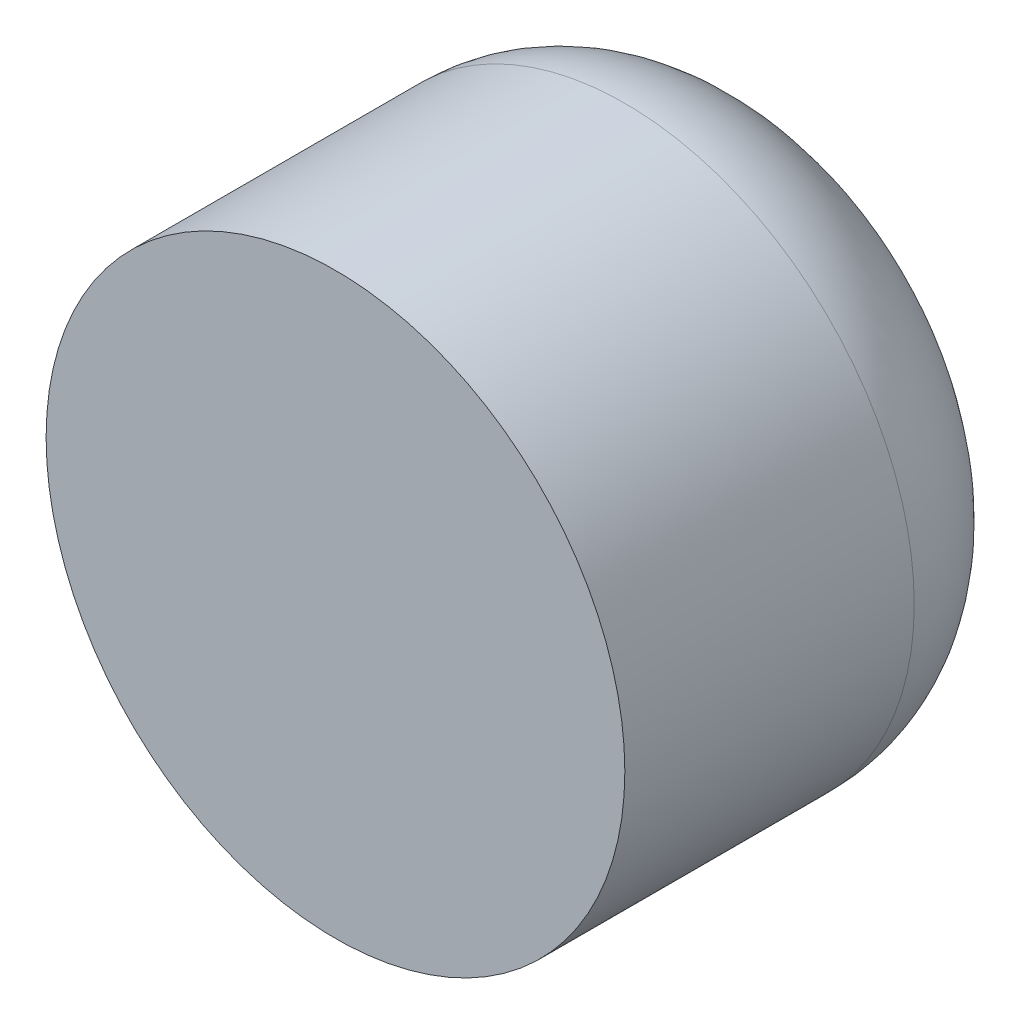
ISO-10303-21;
HEADER;
FILE_DESCRIPTION(('STEP AP214'),'2;1');
FILE_NAME('part.step','',(''),(''),'','','');
FILE_SCHEMA(('AUTOMOTIVE_DESIGN { 1 0 10303 214 1 1 1 1 }'));
ENDSEC;
DATA;
#1=APPLICATION_CONTEXT('core data for automotive mechanical design processes');
#2=APPLICATION_PROTOCOL_DEFINITION('international standard','automotive_design',2000,#1);
#3=PRODUCT_CONTEXT('',#1,'mechanical');
#4=PRODUCT('Part','Part','',(#3));
#5=PRODUCT_RELATED_PRODUCT_CATEGORY('part','',(#4));
#6=PRODUCT_DEFINITION_FORMATION('','',#4);
#7=PRODUCT_DEFINITION_CONTEXT('part definition',#1,'design');
#8=PRODUCT_DEFINITION('design','',#6,#7);
#9=PRODUCT_DEFINITION_SHAPE('','',#8);
#10=(LENGTH_UNIT() NAMED_UNIT(*) SI_UNIT(.MILLI.,.METRE.));
#11=(NAMED_UNIT(*) PLANE_ANGLE_UNIT() SI_UNIT($,.RADIAN.));
#12=(NAMED_UNIT(*) SI_UNIT($,.STERADIAN.) SOLID_ANGLE_UNIT());
#13=UNCERTAINTY_MEASURE_WITH_UNIT(LENGTH_MEASURE(1.E-05),#10,'distance_accuracy_value','');
#14=(GEOMETRIC_REPRESENTATION_CONTEXT(3) GLOBAL_UNCERTAINTY_ASSIGNED_CONTEXT((#13)) GLOBAL_UNIT_ASSIGNED_CONTEXT((#10,
#11,#12)) REPRESENTATION_CONTEXT('',''));
#15=CARTESIAN_POINT('',(0.,0.,0.));
#16=DIRECTION('',(0.,0.,1.));
#17=DIRECTION('',(1.,0.,0.));
#18=AXIS2_PLACEMENT_3D('',#15,#16,#17);
#19=CARTESIAN_POINT('',(-4.5746414921865,1.33641212131291,3.));
#20=DIRECTION('',(0.,0.,-1.));
#21=DIRECTION('',(-1.,0.,0.));
#22=AXIS2_PLACEMENT_3D('',#19,#20,#21);
#23=CYLINDRICAL_SURFACE('',#22,2.);
#24=CARTESIAN_POINT('',(-4.5746414921865,1.33641212131291,1.));
#25=DIRECTION('',(0.,0.,1.));
#26=DIRECTION('',(1.,0.,0.));
#27=AXIS2_PLACEMENT_3D('',#24,#25,#26);
#28=CIRCLE('',#27,2.);
#29=CARTESIAN_POINT('',(-2.5746414921865,1.33641212131291,1.));
#30=VERTEX_POINT('',#29);
#31=EDGE_CURVE('E42',#30,#30,#28,.T.);
#32=ORIENTED_EDGE('',*,*,#31,.T.);
#33=EDGE_LOOP('',(#32));
#34=FACE_BOUND('',#33,.T.);
#35=CARTESIAN_POINT('',(-4.5746414921865,1.33641212131291,3.));
#36=DIRECTION('',(0.,0.,1.));
#37=DIRECTION('',(1.,0.,0.));
#38=AXIS2_PLACEMENT_3D('',#35,#36,#37);
#39=CIRCLE('',#38,2.);
#40=CARTESIAN_POINT('',(-2.5746414921865,1.33641212131291,3.));
#41=VERTEX_POINT('',#40);
#42=EDGE_CURVE('E136',#41,#41,#39,.T.);
#43=ORIENTED_EDGE('',*,*,#42,.F.);
#44=EDGE_LOOP('',(#43));
#45=FACE_BOUND('',#44,.T.);
#46=ADVANCED_FACE('F34',(#34,#45),#23,.T.);
#47=CARTESIAN_POINT('',(-4.5746414921865,1.33641212131291,3.));
#48=DIRECTION('',(0.,0.,1.));
#49=DIRECTION('',(1.,0.,0.));
#50=AXIS2_PLACEMENT_3D('',#47,#48,#49);
#51=PLANE('',#50);
#52=ORIENTED_EDGE('',*,*,#42,.T.);
#53=EDGE_LOOP('',(#52));
#54=FACE_BOUND('',#53,.T.);
#55=ADVANCED_FACE('F157',(#54),#51,.T.);
#56=CARTESIAN_POINT('',(-4.5746414921865,1.33641212131291,0.));
#57=DIRECTION('',(0.,0.,1.));
#58=DIRECTION('',(1.,0.,0.));
#59=AXIS2_PLACEMENT_3D('',#56,#57,#58);
#60=PLANE('',#59);
#61=CARTESIAN_POINT('',(-4.5746414921865,1.33641212131291,0.));
#62=DIRECTION('',(0.,0.,1.));
#63=DIRECTION('',(1.,0.,0.));
#64=AXIS2_PLACEMENT_3D('',#61,#62,#63);
#65=CIRCLE('',#64,1.);
#66=CARTESIAN_POINT('',(-3.5746414921865,1.33641212131291,0.));
#67=VERTEX_POINT('',#66);
#68=EDGE_CURVE('E11',#67,#67,#65,.F.);
#69=ORIENTED_EDGE('',*,*,#68,.T.);
#70=EDGE_LOOP('',(#69));
#71=FACE_BOUND('',#70,.T.);
#72=DIRECTION('',(0.495584554332796,-0.868559698297569,0.));
#73=VECTOR('',#72,1.);
#74=CARTESIAN_POINT('',(-4.11056623960366,2.13084602827675,0.));
#75=LINE('',#74,#73);
#76=CARTESIAN_POINT('',(-4.11056623960366,2.13084602827675,0.));
#77=VERTEX_POINT('',#76);
#78=CARTESIAN_POINT('',(-3.65460392083667,1.33172811679041,0.));
#79=VERTEX_POINT('',#78);
#80=EDGE_CURVE('E123',#77,#79,#75,.T.);
#81=ORIENTED_EDGE('',*,*,#80,.F.);
#82=DIRECTION('',(0.99998704059544,-0.00509103537339352,0.));
#83=VECTOR('',#82,1.);
#84=CARTESIAN_POINT('',(-5.03060381095349,2.13553003279925,0.));
#85=LINE('',#84,#83);
#86=CARTESIAN_POINT('',(-5.03060381095349,2.13553003279925,0.));
#87=VERTEX_POINT('',#86);
#88=EDGE_CURVE('E49',#87,#77,#85,.T.);
#89=ORIENTED_EDGE('',*,*,#88,.F.);
#90=DIRECTION('',(0.504402486262643,0.863468662924176,0.));
#91=VECTOR('',#90,1.);
#92=CARTESIAN_POINT('',(-5.49467906353633,1.34109612583541,0.));
#93=LINE('',#92,#91);
#94=CARTESIAN_POINT('',(-5.49467906353633,1.34109612583541,0.));
#95=VERTEX_POINT('',#94);
#96=EDGE_CURVE('E132',#95,#87,#93,.T.);
#97=ORIENTED_EDGE('',*,*,#96,.F.);
#98=DIRECTION('',(-0.495584554332796,0.868559698297569,0.));
#99=VECTOR('',#98,1.);
#100=CARTESIAN_POINT('',(-5.03871674476935,0.54197821434907,0.));
#101=LINE('',#100,#99);
#102=CARTESIAN_POINT('',(-5.03871674476935,0.54197821434907,0.));
#103=VERTEX_POINT('',#102);
#104=EDGE_CURVE('E130',#103,#95,#101,.T.);
#105=ORIENTED_EDGE('',*,*,#104,.F.);
#106=DIRECTION('',(-0.99998704059544,0.00509103537339302,0.));
#107=VECTOR('',#106,1.);
#108=CARTESIAN_POINT('',(-4.11867917341951,0.537294209826568,0.));
#109=LINE('',#108,#107);
#110=CARTESIAN_POINT('',(-4.11867917341951,0.537294209826568,0.));
#111=VERTEX_POINT('',#110);
#112=EDGE_CURVE('E97',#111,#103,#109,.T.);
#113=ORIENTED_EDGE('',*,*,#112,.F.);
#114=DIRECTION('',(-0.504402486262642,-0.863468662924176,0.));
#115=VECTOR('',#114,1.);
#116=CARTESIAN_POINT('',(-3.65460392083667,1.33172811679041,0.));
#117=LINE('',#116,#115);
#118=EDGE_CURVE('E126',#79,#111,#117,.T.);
#119=ORIENTED_EDGE('',*,*,#118,.F.);
#120=EDGE_LOOP('',(#81,#89,#97,#105,#113,#119));
#121=FACE_BOUND('',#120,.T.);
#122=ADVANCED_FACE('F161',(#71,#121),#60,.F.);
#123=CARTESIAN_POINT('',(-5.03060381095349,2.13553003279925,2.));
#124=DIRECTION('',(0.00509103537339352,0.99998704059544,0.));
#125=DIRECTION('',(-0.99998704059544,0.00509103537339352,0.));
#126=AXIS2_PLACEMENT_3D('',#123,#124,#125);
#127=PLANE('',#126);
#128=ORIENTED_EDGE('',*,*,#88,.T.);
#129=DIRECTION('',(0.,0.,-1.));
#130=VECTOR('',#129,1.);
#131=CARTESIAN_POINT('',(-4.11056623960366,2.13084602827675,2.));
#132=LINE('',#131,#130);
#133=CARTESIAN_POINT('',(-4.11056623960366,2.13084602827675,2.));
#134=VERTEX_POINT('',#133);
#135=EDGE_CURVE('E79',#134,#77,#132,.T.);
#136=ORIENTED_EDGE('',*,*,#135,.F.);
#137=DIRECTION('',(0.99998704059544,-0.00509103537339352,0.));
#138=VECTOR('',#137,1.);
#139=CARTESIAN_POINT('',(-5.03060381095349,2.13553003279925,2.));
#140=LINE('',#139,#138);
#141=CARTESIAN_POINT('',(-5.03060381095349,2.13553003279925,2.));
#142=VERTEX_POINT('',#141);
#143=EDGE_CURVE('E134',#142,#134,#140,.T.);
#144=ORIENTED_EDGE('',*,*,#143,.F.);
#145=DIRECTION('',(0.,0.,-1.));
#146=VECTOR('',#145,1.);
#147=CARTESIAN_POINT('',(-5.03060381095349,2.13553003279925,2.));
#148=LINE('',#147,#146);
#149=EDGE_CURVE('E57',#142,#87,#148,.T.);
#150=ORIENTED_EDGE('',*,*,#149,.T.);
#151=EDGE_LOOP('',(#128,#136,#144,#150));
#152=FACE_BOUND('',#151,.T.);
#153=ADVANCED_FACE('F166',(#152),#127,.F.);
#154=CARTESIAN_POINT('',(-5.49467906353633,1.34109612583541,2.));
#155=DIRECTION('',(-0.863468662924176,0.504402486262644,0.));
#156=DIRECTION('',(-0.504402486262643,-0.863468662924176,0.));
#157=AXIS2_PLACEMENT_3D('',#154,#155,#156);
#158=PLANE('',#157);
#159=ORIENTED_EDGE('',*,*,#96,.T.);
#160=ORIENTED_EDGE('',*,*,#149,.F.);
#161=DIRECTION('',(0.504402486262643,0.863468662924176,0.));
#162=VECTOR('',#161,1.);
#163=CARTESIAN_POINT('',(-5.49467906353633,1.34109612583541,2.));
#164=LINE('',#163,#162);
#165=CARTESIAN_POINT('',(-5.49467906353633,1.34109612583541,2.));
#166=VERTEX_POINT('',#165);
#167=EDGE_CURVE('E109',#166,#142,#164,.T.);
#168=ORIENTED_EDGE('',*,*,#167,.F.);
#169=DIRECTION('',(0.,0.,-1.));
#170=VECTOR('',#169,1.);
#171=CARTESIAN_POINT('',(-5.49467906353633,1.34109612583541,2.));
#172=LINE('',#171,#170);
#173=EDGE_CURVE('E101',#166,#95,#172,.T.);
#174=ORIENTED_EDGE('',*,*,#173,.T.);
#175=EDGE_LOOP('',(#159,#160,#168,#174));
#176=FACE_BOUND('',#175,.T.);
#177=ADVANCED_FACE('F171',(#176),#158,.F.);
#178=CARTESIAN_POINT('',(-5.03871674476935,0.54197821434907,2.));
#179=DIRECTION('',(-0.868559698297569,-0.495584554332796,0.));
#180=DIRECTION('',(0.495584554332796,-0.868559698297569,0.));
#181=AXIS2_PLACEMENT_3D('',#178,#179,#180);
#182=PLANE('',#181);
#183=ORIENTED_EDGE('',*,*,#104,.T.);
#184=ORIENTED_EDGE('',*,*,#173,.F.);
#185=DIRECTION('',(-0.495584554332796,0.868559698297569,0.));
#186=VECTOR('',#185,1.);
#187=CARTESIAN_POINT('',(-5.03871674476935,0.54197821434907,2.));
#188=LINE('',#187,#186);
#189=CARTESIAN_POINT('',(-5.03871674476935,0.54197821434907,2.));
#190=VERTEX_POINT('',#189);
#191=EDGE_CURVE('E105',#190,#166,#188,.T.);
#192=ORIENTED_EDGE('',*,*,#191,.F.);
#193=DIRECTION('',(0.,0.,-1.));
#194=VECTOR('',#193,1.);
#195=CARTESIAN_POINT('',(-5.03871674476935,0.54197821434907,2.));
#196=LINE('',#195,#194);
#197=EDGE_CURVE('E90',#190,#103,#196,.T.);
#198=ORIENTED_EDGE('',*,*,#197,.T.);
#199=EDGE_LOOP('',(#183,#184,#192,#198));
#200=FACE_BOUND('',#199,.T.);
#201=ADVANCED_FACE('F106',(#200),#182,.F.);
#202=CARTESIAN_POINT('',(-4.11867917341951,0.537294209826568,2.));
#203=DIRECTION('',(-0.00509103537339303,-0.99998704059544,0.));
#204=DIRECTION('',(0.99998704059544,-0.00509103537339303,0.));
#205=AXIS2_PLACEMENT_3D('',#202,#203,#204);
#206=PLANE('',#205);
#207=ORIENTED_EDGE('',*,*,#112,.T.);
#208=ORIENTED_EDGE('',*,*,#197,.F.);
#209=DIRECTION('',(-0.99998704059544,0.00509103537339302,0.));
#210=VECTOR('',#209,1.);
#211=CARTESIAN_POINT('',(-4.11867917341951,0.537294209826568,2.));
#212=LINE('',#211,#210);
#213=CARTESIAN_POINT('',(-4.11867917341951,0.537294209826568,2.));
#214=VERTEX_POINT('',#213);
#215=EDGE_CURVE('E94',#214,#190,#212,.T.);
#216=ORIENTED_EDGE('',*,*,#215,.F.);
#217=DIRECTION('',(0.,0.,-1.));
#218=VECTOR('',#217,1.);
#219=CARTESIAN_POINT('',(-4.11867917341951,0.537294209826568,2.));
#220=LINE('',#219,#218);
#221=EDGE_CURVE('E102',#214,#111,#220,.T.);
#222=ORIENTED_EDGE('',*,*,#221,.T.);
#223=EDGE_LOOP('',(#207,#208,#216,#222));
#224=FACE_BOUND('',#223,.T.);
#225=ADVANCED_FACE('F92',(#224),#206,.F.);
#226=CARTESIAN_POINT('',(-3.65460392083667,1.33172811679041,2.));
#227=DIRECTION('',(0.863468662924176,-0.504402486262643,0.));
#228=DIRECTION('',(0.504402486262643,0.863468662924176,0.));
#229=AXIS2_PLACEMENT_3D('',#226,#227,#228);
#230=PLANE('',#229);
#231=ORIENTED_EDGE('',*,*,#118,.T.);
#232=ORIENTED_EDGE('',*,*,#221,.F.);
#233=DIRECTION('',(-0.504402486262642,-0.863468662924176,0.));
#234=VECTOR('',#233,1.);
#235=CARTESIAN_POINT('',(-3.65460392083667,1.33172811679041,2.));
#236=LINE('',#235,#234);
#237=CARTESIAN_POINT('',(-3.65460392083667,1.33172811679041,2.));
#238=VERTEX_POINT('',#237);
#239=EDGE_CURVE('E115',#238,#214,#236,.T.);
#240=ORIENTED_EDGE('',*,*,#239,.F.);
#241=DIRECTION('',(0.,0.,-1.));
#242=VECTOR('',#241,1.);
#243=CARTESIAN_POINT('',(-3.65460392083667,1.33172811679041,2.));
#244=LINE('',#243,#242);
#245=EDGE_CURVE('E139',#238,#79,#244,.T.);
#246=ORIENTED_EDGE('',*,*,#245,.T.);
#247=EDGE_LOOP('',(#231,#232,#240,#246));
#248=FACE_BOUND('',#247,.T.);
#249=ADVANCED_FACE('F174',(#248),#230,.F.);
#250=CARTESIAN_POINT('',(-4.11056623960366,2.13084602827675,2.));
#251=DIRECTION('',(0.868559698297569,0.495584554332796,0.));
#252=DIRECTION('',(-0.495584554332796,0.868559698297569,0.));
#253=AXIS2_PLACEMENT_3D('',#250,#251,#252);
#254=PLANE('',#253);
#255=ORIENTED_EDGE('',*,*,#80,.T.);
#256=ORIENTED_EDGE('',*,*,#245,.F.);
#257=DIRECTION('',(0.495584554332796,-0.868559698297569,0.));
#258=VECTOR('',#257,1.);
#259=CARTESIAN_POINT('',(-4.11056623960366,2.13084602827675,2.));
#260=LINE('',#259,#258);
#261=EDGE_CURVE('E117',#134,#238,#260,.T.);
#262=ORIENTED_EDGE('',*,*,#261,.F.);
#263=ORIENTED_EDGE('',*,*,#135,.T.);
#264=EDGE_LOOP('',(#255,#256,#262,#263));
#265=FACE_BOUND('',#264,.T.);
#266=ADVANCED_FACE('F153',(#265),#254,.F.);
#267=CARTESIAN_POINT('',(0.,0.,2.));
#268=DIRECTION('',(0.,0.,-1.));
#269=DIRECTION('',(-1.,0.,0.));
#270=AXIS2_PLACEMENT_3D('',#267,#268,#269);
#271=PLANE('',#270);
#272=ORIENTED_EDGE('',*,*,#143,.T.);
#273=ORIENTED_EDGE('',*,*,#261,.T.);
#274=ORIENTED_EDGE('',*,*,#239,.T.);
#275=ORIENTED_EDGE('',*,*,#215,.T.);
#276=ORIENTED_EDGE('',*,*,#191,.T.);
#277=ORIENTED_EDGE('',*,*,#167,.T.);
#278=EDGE_LOOP('',(#272,#273,#274,#275,#276,#277));
#279=FACE_BOUND('',#278,.T.);
#280=ADVANCED_FACE('F112',(#279),#271,.T.);
#281=CARTESIAN_POINT('',(-4.5746414921865,1.33641212131291,1.));
#282=DIRECTION('',(0.,0.,1.));
#283=DIRECTION('',(1.,0.,0.));
#284=AXIS2_PLACEMENT_3D('',#281,#282,#283);
#285=DEGENERATE_TOROIDAL_SURFACE('',#284,1.,1.,.T.);
#286=ORIENTED_EDGE('',*,*,#68,.F.);
#287=EDGE_LOOP('',(#286));
#288=FACE_BOUND('',#287,.T.);
#289=ORIENTED_EDGE('',*,*,#31,.F.);
#290=EDGE_LOOP('',(#289));
#291=FACE_BOUND('',#290,.T.);
#292=ADVANCED_FACE('F36',(#288,#291),#285,.T.);
#293=CLOSED_SHELL('',(#46,#55,#122,#153,#177,#201,#225,#249,#266,#280,#292));
#294=MANIFOLD_SOLID_BREP('B2',#293);
#295=ADVANCED_BREP_SHAPE_REPRESENTATION('',(#18,#294),#14);
#296=SHAPE_DEFINITION_REPRESENTATION(#9,#295);
ENDSEC;
END-ISO-10303-21;
